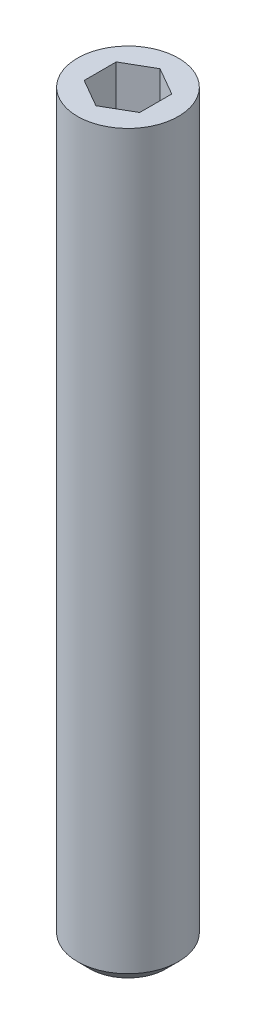
ISO-10303-21;
HEADER;
FILE_DESCRIPTION(('STEP AP214'),'2;1');
FILE_NAME('part.step','',(''),(''),'','','');
FILE_SCHEMA(('AUTOMOTIVE_DESIGN { 1 0 10303 214 1 1 1 1 }'));
ENDSEC;
DATA;
#1=APPLICATION_CONTEXT('core data for automotive mechanical design processes');
#2=APPLICATION_PROTOCOL_DEFINITION('international standard','automotive_design',2000,#1);
#3=PRODUCT_CONTEXT('',#1,'mechanical');
#4=PRODUCT('Part','Part','',(#3));
#5=PRODUCT_RELATED_PRODUCT_CATEGORY('part','',(#4));
#6=PRODUCT_DEFINITION_FORMATION('','',#4);
#7=PRODUCT_DEFINITION_CONTEXT('part definition',#1,'design');
#8=PRODUCT_DEFINITION('design','',#6,#7);
#9=PRODUCT_DEFINITION_SHAPE('','',#8);
#10=(LENGTH_UNIT() NAMED_UNIT(*) SI_UNIT(.MILLI.,.METRE.));
#11=(NAMED_UNIT(*) PLANE_ANGLE_UNIT() SI_UNIT($,.RADIAN.));
#12=(NAMED_UNIT(*) SI_UNIT($,.STERADIAN.) SOLID_ANGLE_UNIT());
#13=UNCERTAINTY_MEASURE_WITH_UNIT(LENGTH_MEASURE(1.E-05),#10,'distance_accuracy_value','');
#14=(GEOMETRIC_REPRESENTATION_CONTEXT(3) GLOBAL_UNCERTAINTY_ASSIGNED_CONTEXT((#13)) GLOBAL_UNIT_ASSIGNED_CONTEXT((#10,
#11,#12)) REPRESENTATION_CONTEXT('',''));
#15=CARTESIAN_POINT('',(0.,0.,0.));
#16=DIRECTION('',(0.,0.,1.));
#17=DIRECTION('',(1.,0.,0.));
#18=AXIS2_PLACEMENT_3D('',#15,#16,#17);
#19=CARTESIAN_POINT('',(0.,29.5,0.));
#20=DIRECTION('',(0.,-1.,0.));
#21=DIRECTION('',(0.,0.,-1.));
#22=AXIS2_PLACEMENT_3D('',#19,#20,#21);
#23=CYLINDRICAL_SURFACE('',#22,2.);
#24=CARTESIAN_POINT('',(0.,0.5,0.));
#25=DIRECTION('',(0.,1.,0.));
#26=DIRECTION('',(0.,0.,1.));
#27=AXIS2_PLACEMENT_3D('',#24,#25,#26);
#28=CIRCLE('',#27,2.);
#29=CARTESIAN_POINT('',(0.,0.5,2.));
#30=VERTEX_POINT('',#29);
#31=EDGE_CURVE('E46',#30,#30,#28,.T.);
#32=ORIENTED_EDGE('',*,*,#31,.T.);
#33=EDGE_LOOP('',(#32));
#34=FACE_BOUND('',#33,.T.);
#35=CARTESIAN_POINT('',(0.,29.5,0.));
#36=DIRECTION('',(0.,1.,0.));
#37=DIRECTION('',(0.,0.,1.));
#38=AXIS2_PLACEMENT_3D('',#35,#36,#37);
#39=CIRCLE('',#38,2.);
#40=CARTESIAN_POINT('',(0.,29.5,2.));
#41=VERTEX_POINT('',#40);
#42=EDGE_CURVE('E140',#41,#41,#39,.T.);
#43=ORIENTED_EDGE('',*,*,#42,.F.);
#44=EDGE_LOOP('',(#43));
#45=FACE_BOUND('',#44,.T.);
#46=ADVANCED_FACE('F37',(#34,#45),#23,.T.);
#47=CARTESIAN_POINT('',(0.,29.5,0.));
#48=DIRECTION('',(0.,1.,0.));
#49=DIRECTION('',(0.,0.,1.));
#50=AXIS2_PLACEMENT_3D('',#47,#48,#49);
#51=PLANE('',#50);
#52=DIRECTION('',(0.,0.,-1.));
#53=VECTOR('',#52,1.);
#54=CARTESIAN_POINT('',(1.1,29.5,0.635085296108588));
#55=LINE('',#54,#53);
#56=CARTESIAN_POINT('',(1.1,29.5,0.635085296108588));
#57=VERTEX_POINT('',#56);
#58=CARTESIAN_POINT('',(1.1,29.5,-0.635085296108588));
#59=VERTEX_POINT('',#58);
#60=EDGE_CURVE('E53',#57,#59,#55,.T.);
#61=ORIENTED_EDGE('',*,*,#60,.F.);
#62=DIRECTION('',(0.866025403784439,0.,-0.5));
#63=VECTOR('',#62,1.);
#64=CARTESIAN_POINT('',(0.,29.5,1.27017059221718));
#65=LINE('',#64,#63);
#66=CARTESIAN_POINT('',(0.,29.5,1.27017059221718));
#67=VERTEX_POINT('',#66);
#68=EDGE_CURVE('E136',#67,#57,#65,.T.);
#69=ORIENTED_EDGE('',*,*,#68,.F.);
#70=DIRECTION('',(0.866025403784438,0.,0.5));
#71=VECTOR('',#70,1.);
#72=CARTESIAN_POINT('',(-1.1,29.5,0.635085296108588));
#73=LINE('',#72,#71);
#74=CARTESIAN_POINT('',(-1.1,29.5,0.635085296108588));
#75=VERTEX_POINT('',#74);
#76=EDGE_CURVE('E134',#75,#67,#73,.T.);
#77=ORIENTED_EDGE('',*,*,#76,.F.);
#78=DIRECTION('',(0.,0.,1.));
#79=VECTOR('',#78,1.);
#80=CARTESIAN_POINT('',(-1.1,29.5,-0.635085296108588));
#81=LINE('',#80,#79);
#82=CARTESIAN_POINT('',(-1.1,29.5,-0.635085296108588));
#83=VERTEX_POINT('',#82);
#84=EDGE_CURVE('E101',#83,#75,#81,.T.);
#85=ORIENTED_EDGE('',*,*,#84,.F.);
#86=DIRECTION('',(-0.866025403784439,0.,0.5));
#87=VECTOR('',#86,1.);
#88=CARTESIAN_POINT('',(0.,29.5,-1.27017059221718));
#89=LINE('',#88,#87);
#90=CARTESIAN_POINT('',(0.,29.5,-1.27017059221718));
#91=VERTEX_POINT('',#90);
#92=EDGE_CURVE('E130',#91,#83,#89,.T.);
#93=ORIENTED_EDGE('',*,*,#92,.F.);
#94=DIRECTION('',(-0.866025403784439,0.,-0.5));
#95=VECTOR('',#94,1.);
#96=CARTESIAN_POINT('',(1.1,29.5,-0.635085296108588));
#97=LINE('',#96,#95);
#98=EDGE_CURVE('E127',#59,#91,#97,.T.);
#99=ORIENTED_EDGE('',*,*,#98,.F.);
#100=EDGE_LOOP('',(#61,#69,#77,#85,#93,#99));
#101=FACE_BOUND('',#100,.T.);
#102=ORIENTED_EDGE('',*,*,#42,.T.);
#103=EDGE_LOOP('',(#102));
#104=FACE_BOUND('',#103,.T.);
#105=ADVANCED_FACE('F162',(#101,#104),#51,.T.);
#106=CARTESIAN_POINT('',(0.,0.,0.));
#107=DIRECTION('',(0.,1.,0.));
#108=DIRECTION('',(0.,0.,1.));
#109=AXIS2_PLACEMENT_3D('',#106,#107,#108);
#110=PLANE('',#109);
#111=CARTESIAN_POINT('',(0.,0.,0.));
#112=DIRECTION('',(0.,1.,0.));
#113=DIRECTION('',(0.,0.,1.));
#114=AXIS2_PLACEMENT_3D('',#111,#112,#113);
#115=CIRCLE('',#114,1.5);
#116=CARTESIAN_POINT('',(0.,0.,1.5));
#117=VERTEX_POINT('',#116);
#118=EDGE_CURVE('E11',#117,#117,#115,.F.);
#119=ORIENTED_EDGE('',*,*,#118,.T.);
#120=EDGE_LOOP('',(#119));
#121=FACE_BOUND('',#120,.T.);
#122=ADVANCED_FACE('F154',(#121),#110,.F.);
#123=CARTESIAN_POINT('',(0.,0.5,0.));
#124=DIRECTION('',(0.,1.,0.));
#125=DIRECTION('',(0.,0.,1.));
#126=AXIS2_PLACEMENT_3D('',#123,#124,#125);
#127=CONICAL_SURFACE('',#126,2.,0.785398163397447);
#128=ORIENTED_EDGE('',*,*,#118,.F.);
#129=EDGE_LOOP('',(#128));
#130=FACE_BOUND('',#129,.T.);
#131=ORIENTED_EDGE('',*,*,#31,.F.);
#132=EDGE_LOOP('',(#131));
#133=FACE_BOUND('',#132,.T.);
#134=ADVANCED_FACE('F40',(#130,#133),#127,.T.);
#135=CARTESIAN_POINT('',(1.1,27.5,0.635085296108588));
#136=DIRECTION('',(1.,0.,0.));
#137=DIRECTION('',(0.,0.,-1.));
#138=AXIS2_PLACEMENT_3D('',#135,#136,#137);
#139=PLANE('',#138);
#140=ORIENTED_EDGE('',*,*,#60,.T.);
#141=DIRECTION('',(0.,1.,0.));
#142=VECTOR('',#141,1.);
#143=CARTESIAN_POINT('',(1.1,27.5,-0.635085296108588));
#144=LINE('',#143,#142);
#145=CARTESIAN_POINT('',(1.1,27.5,-0.635085296108588));
#146=VERTEX_POINT('',#145);
#147=EDGE_CURVE('E83',#146,#59,#144,.T.);
#148=ORIENTED_EDGE('',*,*,#147,.F.);
#149=DIRECTION('',(0.,0.,-1.));
#150=VECTOR('',#149,1.);
#151=CARTESIAN_POINT('',(1.1,27.5,0.635085296108588));
#152=LINE('',#151,#150);
#153=CARTESIAN_POINT('',(1.1,27.5,0.635085296108588));
#154=VERTEX_POINT('',#153);
#155=EDGE_CURVE('E138',#154,#146,#152,.T.);
#156=ORIENTED_EDGE('',*,*,#155,.F.);
#157=DIRECTION('',(0.,1.,0.));
#158=VECTOR('',#157,1.);
#159=CARTESIAN_POINT('',(1.1,27.5,0.635085296108588));
#160=LINE('',#159,#158);
#161=EDGE_CURVE('E61',#154,#57,#160,.T.);
#162=ORIENTED_EDGE('',*,*,#161,.T.);
#163=EDGE_LOOP('',(#140,#148,#156,#162));
#164=FACE_BOUND('',#163,.T.);
#165=ADVANCED_FACE('F153',(#164),#139,.F.);
#166=CARTESIAN_POINT('',(0.,27.5,1.27017059221718));
#167=DIRECTION('',(0.5,0.,0.866025403784439));
#168=DIRECTION('',(0.866025403784439,0.,-0.5));
#169=AXIS2_PLACEMENT_3D('',#166,#167,#168);
#170=PLANE('',#169);
#171=ORIENTED_EDGE('',*,*,#68,.T.);
#172=ORIENTED_EDGE('',*,*,#161,.F.);
#173=DIRECTION('',(0.866025403784439,0.,-0.5));
#174=VECTOR('',#173,1.);
#175=CARTESIAN_POINT('',(0.,27.5,1.27017059221718));
#176=LINE('',#175,#174);
#177=CARTESIAN_POINT('',(0.,27.5,1.27017059221718));
#178=VERTEX_POINT('',#177);
#179=EDGE_CURVE('E113',#178,#154,#176,.T.);
#180=ORIENTED_EDGE('',*,*,#179,.F.);
#181=DIRECTION('',(0.,1.,0.));
#182=VECTOR('',#181,1.);
#183=CARTESIAN_POINT('',(0.,27.5,1.27017059221718));
#184=LINE('',#183,#182);
#185=EDGE_CURVE('E105',#178,#67,#184,.T.);
#186=ORIENTED_EDGE('',*,*,#185,.T.);
#187=EDGE_LOOP('',(#171,#172,#180,#186));
#188=FACE_BOUND('',#187,.T.);
#189=ADVANCED_FACE('F160',(#188),#170,.F.);
#190=CARTESIAN_POINT('',(-1.1,27.5,0.635085296108588));
#191=DIRECTION('',(-0.5,0.,0.866025403784438));
#192=DIRECTION('',(0.866025403784439,0.,0.5));
#193=AXIS2_PLACEMENT_3D('',#190,#191,#192);
#194=PLANE('',#193);
#195=ORIENTED_EDGE('',*,*,#76,.T.);
#196=ORIENTED_EDGE('',*,*,#185,.F.);
#197=DIRECTION('',(0.866025403784438,0.,0.5));
#198=VECTOR('',#197,1.);
#199=CARTESIAN_POINT('',(-1.1,27.5,0.635085296108588));
#200=LINE('',#199,#198);
#201=CARTESIAN_POINT('',(-1.1,27.5,0.635085296108588));
#202=VERTEX_POINT('',#201);
#203=EDGE_CURVE('E109',#202,#178,#200,.T.);
#204=ORIENTED_EDGE('',*,*,#203,.F.);
#205=DIRECTION('',(0.,1.,0.));
#206=VECTOR('',#205,1.);
#207=CARTESIAN_POINT('',(-1.1,27.5,0.635085296108588));
#208=LINE('',#207,#206);
#209=EDGE_CURVE('E94',#202,#75,#208,.T.);
#210=ORIENTED_EDGE('',*,*,#209,.T.);
#211=EDGE_LOOP('',(#195,#196,#204,#210));
#212=FACE_BOUND('',#211,.T.);
#213=ADVANCED_FACE('F110',(#212),#194,.F.);
#214=CARTESIAN_POINT('',(-1.1,27.5,-0.635085296108588));
#215=DIRECTION('',(-1.,0.,0.));
#216=DIRECTION('',(0.,0.,1.));
#217=AXIS2_PLACEMENT_3D('',#214,#215,#216);
#218=PLANE('',#217);
#219=ORIENTED_EDGE('',*,*,#84,.T.);
#220=ORIENTED_EDGE('',*,*,#209,.F.);
#221=DIRECTION('',(0.,0.,1.));
#222=VECTOR('',#221,1.);
#223=CARTESIAN_POINT('',(-1.1,27.5,-0.635085296108588));
#224=LINE('',#223,#222);
#225=CARTESIAN_POINT('',(-1.1,27.5,-0.635085296108588));
#226=VERTEX_POINT('',#225);
#227=EDGE_CURVE('E98',#226,#202,#224,.T.);
#228=ORIENTED_EDGE('',*,*,#227,.F.);
#229=DIRECTION('',(0.,1.,0.));
#230=VECTOR('',#229,1.);
#231=CARTESIAN_POINT('',(-1.1,27.5,-0.635085296108588));
#232=LINE('',#231,#230);
#233=EDGE_CURVE('E106',#226,#83,#232,.T.);
#234=ORIENTED_EDGE('',*,*,#233,.T.);
#235=EDGE_LOOP('',(#219,#220,#228,#234));
#236=FACE_BOUND('',#235,.T.);
#237=ADVANCED_FACE('F96',(#236),#218,.F.);
#238=CARTESIAN_POINT('',(0.,27.5,-1.27017059221718));
#239=DIRECTION('',(-0.5,0.,-0.866025403784439));
#240=DIRECTION('',(-0.866025403784439,0.,0.5));
#241=AXIS2_PLACEMENT_3D('',#238,#239,#240);
#242=PLANE('',#241);
#243=ORIENTED_EDGE('',*,*,#92,.T.);
#244=ORIENTED_EDGE('',*,*,#233,.F.);
#245=DIRECTION('',(-0.866025403784439,0.,0.5));
#246=VECTOR('',#245,1.);
#247=CARTESIAN_POINT('',(0.,27.5,-1.27017059221718));
#248=LINE('',#247,#246);
#249=CARTESIAN_POINT('',(0.,27.5,-1.27017059221718));
#250=VERTEX_POINT('',#249);
#251=EDGE_CURVE('E119',#250,#226,#248,.T.);
#252=ORIENTED_EDGE('',*,*,#251,.F.);
#253=DIRECTION('',(0.,1.,0.));
#254=VECTOR('',#253,1.);
#255=CARTESIAN_POINT('',(0.,27.5,-1.27017059221718));
#256=LINE('',#255,#254);
#257=EDGE_CURVE('E143',#250,#91,#256,.T.);
#258=ORIENTED_EDGE('',*,*,#257,.T.);
#259=EDGE_LOOP('',(#243,#244,#252,#258));
#260=FACE_BOUND('',#259,.T.);
#261=ADVANCED_FACE('F176',(#260),#242,.F.);
#262=CARTESIAN_POINT('',(1.1,27.5,-0.635085296108588));
#263=DIRECTION('',(0.5,0.,-0.866025403784439));
#264=DIRECTION('',(-0.866025403784439,0.,-0.5));
#265=AXIS2_PLACEMENT_3D('',#262,#263,#264);
#266=PLANE('',#265);
#267=ORIENTED_EDGE('',*,*,#98,.T.);
#268=ORIENTED_EDGE('',*,*,#257,.F.);
#269=DIRECTION('',(-0.866025403784439,0.,-0.5));
#270=VECTOR('',#269,1.);
#271=CARTESIAN_POINT('',(1.1,27.5,-0.635085296108588));
#272=LINE('',#271,#270);
#273=EDGE_CURVE('E121',#146,#250,#272,.T.);
#274=ORIENTED_EDGE('',*,*,#273,.F.);
#275=ORIENTED_EDGE('',*,*,#147,.T.);
#276=EDGE_LOOP('',(#267,#268,#274,#275));
#277=FACE_BOUND('',#276,.T.);
#278=ADVANCED_FACE('F173',(#277),#266,.F.);
#279=CARTESIAN_POINT('',(0.,27.5,0.));
#280=DIRECTION('',(0.,1.,0.));
#281=DIRECTION('',(0.,0.,1.));
#282=AXIS2_PLACEMENT_3D('',#279,#280,#281);
#283=PLANE('',#282);
#284=ORIENTED_EDGE('',*,*,#155,.T.);
#285=ORIENTED_EDGE('',*,*,#273,.T.);
#286=ORIENTED_EDGE('',*,*,#251,.T.);
#287=ORIENTED_EDGE('',*,*,#227,.T.);
#288=ORIENTED_EDGE('',*,*,#203,.T.);
#289=ORIENTED_EDGE('',*,*,#179,.T.);
#290=EDGE_LOOP('',(#284,#285,#286,#287,#288,#289));
#291=FACE_BOUND('',#290,.T.);
#292=ADVANCED_FACE('F116',(#291),#283,.T.);
#293=CLOSED_SHELL('',(#46,#105,#122,#134,#165,#189,#213,#237,#261,#278,#292));
#294=MANIFOLD_SOLID_BREP('B2',#293);
#295=ADVANCED_BREP_SHAPE_REPRESENTATION('',(#18,#294),#14);
#296=SHAPE_DEFINITION_REPRESENTATION(#9,#295);
ENDSEC;
END-ISO-10303-21;
